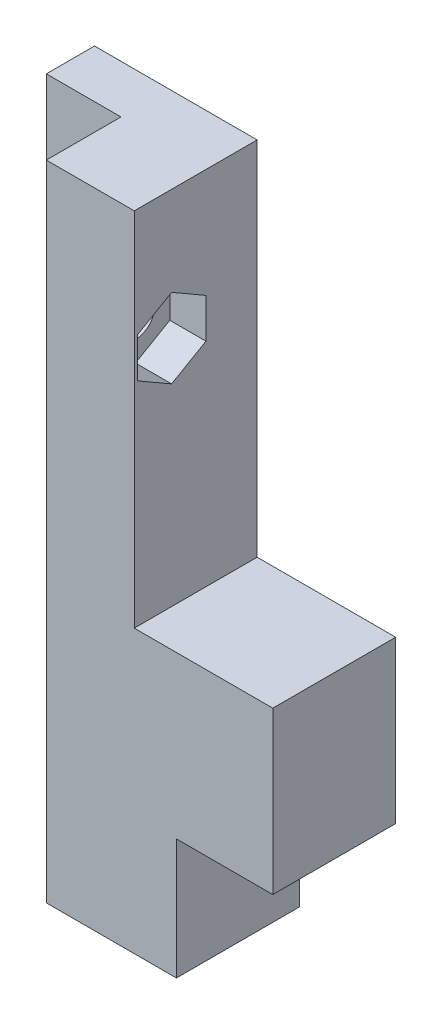
ISO-10303-21;
HEADER;
FILE_DESCRIPTION(('STEP AP214'),'2;1');
FILE_NAME('part.step','',(''),(''),'','','');
FILE_SCHEMA(('AUTOMOTIVE_DESIGN { 1 0 10303 214 1 1 1 1 }'));
ENDSEC;
DATA;
#1=APPLICATION_CONTEXT('core data for automotive mechanical design processes');
#2=APPLICATION_PROTOCOL_DEFINITION('international standard','automotive_design',2000,#1);
#3=PRODUCT_CONTEXT('',#1,'mechanical');
#4=PRODUCT('Part','Part','',(#3));
#5=PRODUCT_RELATED_PRODUCT_CATEGORY('part','',(#4));
#6=PRODUCT_DEFINITION_FORMATION('','',#4);
#7=PRODUCT_DEFINITION_CONTEXT('part definition',#1,'design');
#8=PRODUCT_DEFINITION('design','',#6,#7);
#9=PRODUCT_DEFINITION_SHAPE('','',#8);
#10=(LENGTH_UNIT() NAMED_UNIT(*) SI_UNIT(.MILLI.,.METRE.));
#11=(NAMED_UNIT(*) PLANE_ANGLE_UNIT() SI_UNIT($,.RADIAN.));
#12=(NAMED_UNIT(*) SI_UNIT($,.STERADIAN.) SOLID_ANGLE_UNIT());
#13=UNCERTAINTY_MEASURE_WITH_UNIT(LENGTH_MEASURE(1.E-05),#10,'distance_accuracy_value','');
#14=(GEOMETRIC_REPRESENTATION_CONTEXT(3) GLOBAL_UNCERTAINTY_ASSIGNED_CONTEXT((#13)) GLOBAL_UNIT_ASSIGNED_CONTEXT((#10,
#11,#12)) REPRESENTATION_CONTEXT('',''));
#15=CARTESIAN_POINT('',(0.,0.,0.));
#16=DIRECTION('',(0.,0.,1.));
#17=DIRECTION('',(1.,0.,0.));
#18=AXIS2_PLACEMENT_3D('',#15,#16,#17);
#19=CARTESIAN_POINT('',(25.001,24.3,7.1));
#20=DIRECTION('',(-1.,0.,0.));
#21=DIRECTION('',(0.,-1.,0.));
#22=AXIS2_PLACEMENT_3D('',#19,#20,#21);
#23=CYLINDRICAL_SURFACE('',#22,1.6);
#24=CARTESIAN_POINT('',(6.2,24.3,7.1));
#25=DIRECTION('',(-1.,0.,0.));
#26=DIRECTION('',(0.,-1.,0.));
#27=AXIS2_PLACEMENT_3D('',#24,#25,#26);
#28=CIRCLE('',#27,1.6);
#29=CARTESIAN_POINT('',(6.2,22.7,7.1));
#30=VERTEX_POINT('',#29);
#31=EDGE_CURVE('E206',#30,#30,#28,.T.);
#32=ORIENTED_EDGE('',*,*,#31,.T.);
#33=EDGE_LOOP('',(#32));
#34=FACE_BOUND('',#33,.T.);
#35=CARTESIAN_POINT('',(10.5,24.3,7.1));
#36=DIRECTION('',(1.,0.,0.));
#37=DIRECTION('',(0.,0.,-1.));
#38=AXIS2_PLACEMENT_3D('',#35,#36,#37);
#39=CIRCLE('',#38,1.6);
#40=CARTESIAN_POINT('',(10.5,24.3,5.5));
#41=VERTEX_POINT('',#40);
#42=EDGE_CURVE('E203',#41,#41,#39,.F.);
#43=ORIENTED_EDGE('',*,*,#42,.F.);
#44=EDGE_LOOP('',(#43));
#45=FACE_BOUND('',#44,.T.);
#46=ADVANCED_FACE('F31',(#34,#45),#23,.F.);
#47=CARTESIAN_POINT('',(0.,35.,4.));
#48=DIRECTION('',(0.,0.,-1.));
#49=DIRECTION('',(-1.,0.,0.));
#50=AXIS2_PLACEMENT_3D('',#47,#48,#49);
#51=PLANE('',#50);
#52=DIRECTION('',(0.,-1.,0.));
#53=VECTOR('',#52,1.);
#54=CARTESIAN_POINT('',(6.2,35.,4.));
#55=LINE('',#54,#53);
#56=CARTESIAN_POINT('',(6.2,35.,4.));
#57=VERTEX_POINT('',#56);
#58=CARTESIAN_POINT('',(6.2,-18.4,4.));
#59=VERTEX_POINT('',#58);
#60=EDGE_CURVE('E214',#57,#59,#55,.T.);
#61=ORIENTED_EDGE('',*,*,#60,.F.);
#62=DIRECTION('',(-1.,0.,0.));
#63=VECTOR('',#62,1.);
#64=CARTESIAN_POINT('',(0.,35.,4.));
#65=LINE('',#64,#63);
#66=CARTESIAN_POINT('',(0.,35.,4.));
#67=VERTEX_POINT('',#66);
#68=EDGE_CURVE('E152',#57,#67,#65,.T.);
#69=ORIENTED_EDGE('',*,*,#68,.T.);
#70=DIRECTION('',(0.,-1.,0.));
#71=VECTOR('',#70,1.);
#72=CARTESIAN_POINT('',(0.,0.,4.));
#73=LINE('',#72,#71);
#74=CARTESIAN_POINT('',(0.,-18.4,4.));
#75=VERTEX_POINT('',#74);
#76=EDGE_CURVE('E146',#67,#75,#73,.T.);
#77=ORIENTED_EDGE('',*,*,#76,.T.);
#78=DIRECTION('',(-1.,0.,0.));
#79=VECTOR('',#78,1.);
#80=CARTESIAN_POINT('',(6.2,-18.4,4.));
#81=LINE('',#80,#79);
#82=EDGE_CURVE('E150',#59,#75,#81,.T.);
#83=ORIENTED_EDGE('',*,*,#82,.F.);
#84=EDGE_LOOP('',(#61,#69,#77,#83));
#85=FACE_BOUND('',#84,.T.);
#86=ADVANCED_FACE('F148',(#85),#51,.F.);
#87=CARTESIAN_POINT('',(0.,0.,4.));
#88=DIRECTION('',(1.,0.,0.));
#89=DIRECTION('',(0.,0.,-1.));
#90=AXIS2_PLACEMENT_3D('',#87,#88,#89);
#91=PLANE('',#90);
#92=DIRECTION('',(0.,-1.,0.));
#93=VECTOR('',#92,1.);
#94=CARTESIAN_POINT('',(0.,0.,0.));
#95=LINE('',#94,#93);
#96=CARTESIAN_POINT('',(0.,35.,0.));
#97=VERTEX_POINT('',#96);
#98=CARTESIAN_POINT('',(0.,-18.4,0.));
#99=VERTEX_POINT('',#98);
#100=EDGE_CURVE('E161',#97,#99,#95,.T.);
#101=ORIENTED_EDGE('',*,*,#100,.T.);
#102=DIRECTION('',(0.,0.,-1.));
#103=VECTOR('',#102,1.);
#104=CARTESIAN_POINT('',(0.,-18.4,4.));
#105=LINE('',#104,#103);
#106=EDGE_CURVE('E159',#75,#99,#105,.T.);
#107=ORIENTED_EDGE('',*,*,#106,.F.);
#108=ORIENTED_EDGE('',*,*,#76,.F.);
#109=DIRECTION('',(0.,0.,-1.));
#110=VECTOR('',#109,1.);
#111=CARTESIAN_POINT('',(0.,35.,4.));
#112=LINE('',#111,#110);
#113=EDGE_CURVE('E232',#67,#97,#112,.T.);
#114=ORIENTED_EDGE('',*,*,#113,.T.);
#115=EDGE_LOOP('',(#101,#107,#108,#114));
#116=FACE_BOUND('',#115,.T.);
#117=ADVANCED_FACE('F33',(#116),#91,.F.);
#118=CARTESIAN_POINT('',(25.,0.,4.));
#119=DIRECTION('',(-1.,0.,0.));
#120=DIRECTION('',(0.,0.,1.));
#121=AXIS2_PLACEMENT_3D('',#118,#119,#120);
#122=PLANE('',#121);
#123=DIRECTION('',(0.,1.,0.));
#124=VECTOR('',#123,1.);
#125=CARTESIAN_POINT('',(25.,0.,0.));
#126=LINE('',#125,#124);
#127=CARTESIAN_POINT('',(25.,-8.4,0.));
#128=VERTEX_POINT('',#127);
#129=CARTESIAN_POINT('',(25.,5.,0.));
#130=VERTEX_POINT('',#129);
#131=EDGE_CURVE('E225',#128,#130,#126,.T.);
#132=ORIENTED_EDGE('',*,*,#131,.T.);
#133=DIRECTION('',(0.,0.,-1.));
#134=VECTOR('',#133,1.);
#135=CARTESIAN_POINT('',(25.,5.,4.));
#136=LINE('',#135,#134);
#137=CARTESIAN_POINT('',(25.,5.,10.2));
#138=VERTEX_POINT('',#137);
#139=EDGE_CURVE('E11',#138,#130,#136,.T.);
#140=ORIENTED_EDGE('',*,*,#139,.F.);
#141=DIRECTION('',(0.,1.,0.));
#142=VECTOR('',#141,1.);
#143=CARTESIAN_POINT('',(25.,0.,10.2));
#144=LINE('',#143,#142);
#145=CARTESIAN_POINT('',(25.,-8.4,10.2));
#146=VERTEX_POINT('',#145);
#147=EDGE_CURVE('E259',#146,#138,#144,.T.);
#148=ORIENTED_EDGE('',*,*,#147,.F.);
#149=DIRECTION('',(0.,0.,1.));
#150=VECTOR('',#149,1.);
#151=CARTESIAN_POINT('',(25.,-8.4,0.));
#152=LINE('',#151,#150);
#153=EDGE_CURVE('E199',#128,#146,#152,.T.);
#154=ORIENTED_EDGE('',*,*,#153,.F.);
#155=EDGE_LOOP('',(#132,#140,#148,#154));
#156=FACE_BOUND('',#155,.T.);
#157=ADVANCED_FACE('F346',(#156),#122,.F.);
#158=CARTESIAN_POINT('',(25.,5.,4.));
#159=DIRECTION('',(0.,-1.,0.));
#160=DIRECTION('',(1.,0.,0.));
#161=AXIS2_PLACEMENT_3D('',#158,#159,#160);
#162=PLANE('',#161);
#163=DIRECTION('',(-1.,0.,0.));
#164=VECTOR('',#163,1.);
#165=CARTESIAN_POINT('',(25.,5.,0.));
#166=LINE('',#165,#164);
#167=CARTESIAN_POINT('',(13.5,5.,0.));
#168=VERTEX_POINT('',#167);
#169=EDGE_CURVE('E227',#130,#168,#166,.T.);
#170=ORIENTED_EDGE('',*,*,#169,.T.);
#171=DIRECTION('',(0.,0.,-1.));
#172=VECTOR('',#171,1.);
#173=CARTESIAN_POINT('',(13.5,5.,4.));
#174=LINE('',#173,#172);
#175=CARTESIAN_POINT('',(13.5,5.,10.2));
#176=VERTEX_POINT('',#175);
#177=EDGE_CURVE('E40',#176,#168,#174,.T.);
#178=ORIENTED_EDGE('',*,*,#177,.F.);
#179=DIRECTION('',(-1.,0.,0.));
#180=VECTOR('',#179,1.);
#181=CARTESIAN_POINT('',(25.,5.,10.2));
#182=LINE('',#181,#180);
#183=EDGE_CURVE('E258',#138,#176,#182,.T.);
#184=ORIENTED_EDGE('',*,*,#183,.F.);
#185=ORIENTED_EDGE('',*,*,#139,.T.);
#186=EDGE_LOOP('',(#170,#178,#184,#185));
#187=FACE_BOUND('',#186,.T.);
#188=ADVANCED_FACE('F339',(#187),#162,.F.);
#189=CARTESIAN_POINT('',(13.5,35.,4.));
#190=DIRECTION('',(-1.,0.,0.));
#191=DIRECTION('',(0.,-1.,0.));
#192=AXIS2_PLACEMENT_3D('',#189,#190,#191);
#193=PLANE('',#192);
#194=DIRECTION('',(0.,-0.5,0.866025403784438));
#195=VECTOR('',#194,1.);
#196=CARTESIAN_POINT('',(13.5,27.5908965343809,7.1));
#197=LINE('',#196,#195);
#198=CARTESIAN_POINT('',(13.5,27.5908965343809,7.1));
#199=VERTEX_POINT('',#198);
#200=CARTESIAN_POINT('',(13.5,25.9454482671904,9.95000000000001));
#201=VERTEX_POINT('',#200);
#202=EDGE_CURVE('E292',#199,#201,#197,.T.);
#203=ORIENTED_EDGE('',*,*,#202,.F.);
#204=DIRECTION('',(0.,0.5,0.866025403784439));
#205=VECTOR('',#204,1.);
#206=CARTESIAN_POINT('',(13.5,25.9454482671904,4.25));
#207=LINE('',#206,#205);
#208=CARTESIAN_POINT('',(13.5,25.9454482671904,4.25));
#209=VERTEX_POINT('',#208);
#210=EDGE_CURVE('E56',#209,#199,#207,.T.);
#211=ORIENTED_EDGE('',*,*,#210,.F.);
#212=DIRECTION('',(0.,1.,0.));
#213=VECTOR('',#212,1.);
#214=CARTESIAN_POINT('',(13.5,22.6545517328096,4.25));
#215=LINE('',#214,#213);
#216=CARTESIAN_POINT('',(13.5,22.6545517328096,4.25));
#217=VERTEX_POINT('',#216);
#218=EDGE_CURVE('E279',#217,#209,#215,.T.);
#219=ORIENTED_EDGE('',*,*,#218,.F.);
#220=DIRECTION('',(0.,0.5,-0.866025403784439));
#221=VECTOR('',#220,1.);
#222=CARTESIAN_POINT('',(13.5,21.0091034656191,7.1));
#223=LINE('',#222,#221);
#224=CARTESIAN_POINT('',(13.5,21.0091034656191,7.1));
#225=VERTEX_POINT('',#224);
#226=EDGE_CURVE('E283',#225,#217,#223,.T.);
#227=ORIENTED_EDGE('',*,*,#226,.F.);
#228=DIRECTION('',(0.,-0.5,-0.866025403784438));
#229=VECTOR('',#228,1.);
#230=CARTESIAN_POINT('',(13.5,22.6545517328096,9.95000000000001));
#231=LINE('',#230,#229);
#232=CARTESIAN_POINT('',(13.5,22.6545517328096,9.95000000000001));
#233=VERTEX_POINT('',#232);
#234=EDGE_CURVE('E286',#233,#225,#231,.T.);
#235=ORIENTED_EDGE('',*,*,#234,.F.);
#236=DIRECTION('',(0.,-1.,0.));
#237=VECTOR('',#236,1.);
#238=CARTESIAN_POINT('',(13.5,25.9454482671904,9.95000000000001));
#239=LINE('',#238,#237);
#240=EDGE_CURVE('E289',#201,#233,#239,.T.);
#241=ORIENTED_EDGE('',*,*,#240,.F.);
#242=EDGE_LOOP('',(#203,#211,#219,#227,#235,#241));
#243=FACE_BOUND('',#242,.T.);
#244=DIRECTION('',(0.,1.,0.));
#245=VECTOR('',#244,1.);
#246=CARTESIAN_POINT('',(13.5,35.,0.));
#247=LINE('',#246,#245);
#248=CARTESIAN_POINT('',(13.5,35.,0.));
#249=VERTEX_POINT('',#248);
#250=EDGE_CURVE('E229',#168,#249,#247,.T.);
#251=ORIENTED_EDGE('',*,*,#250,.T.);
#252=DIRECTION('',(0.,0.,-1.));
#253=VECTOR('',#252,1.);
#254=CARTESIAN_POINT('',(13.5,35.,4.));
#255=LINE('',#254,#253);
#256=CARTESIAN_POINT('',(13.5,35.,10.2));
#257=VERTEX_POINT('',#256);
#258=EDGE_CURVE('E234',#257,#249,#255,.T.);
#259=ORIENTED_EDGE('',*,*,#258,.F.);
#260=DIRECTION('',(0.,1.,0.));
#261=VECTOR('',#260,1.);
#262=CARTESIAN_POINT('',(13.5,5.,10.2));
#263=LINE('',#262,#261);
#264=EDGE_CURVE('E213',#176,#257,#263,.T.);
#265=ORIENTED_EDGE('',*,*,#264,.F.);
#266=ORIENTED_EDGE('',*,*,#177,.T.);
#267=EDGE_LOOP('',(#251,#259,#265,#266));
#268=FACE_BOUND('',#267,.T.);
#269=ADVANCED_FACE('F241',(#243,#268),#193,.F.);
#270=CARTESIAN_POINT('',(0.,35.,4.));
#271=DIRECTION('',(0.,-1.,0.));
#272=DIRECTION('',(0.,0.,-1.));
#273=AXIS2_PLACEMENT_3D('',#270,#271,#272);
#274=PLANE('',#273);
#275=DIRECTION('',(-1.,0.,0.));
#276=VECTOR('',#275,1.);
#277=CARTESIAN_POINT('',(0.,35.,0.));
#278=LINE('',#277,#276);
#279=EDGE_CURVE('E156',#249,#97,#278,.T.);
#280=ORIENTED_EDGE('',*,*,#279,.T.);
#281=ORIENTED_EDGE('',*,*,#113,.F.);
#282=ORIENTED_EDGE('',*,*,#68,.F.);
#283=DIRECTION('',(0.,0.,-1.));
#284=VECTOR('',#283,1.);
#285=CARTESIAN_POINT('',(6.2,35.,10.2));
#286=LINE('',#285,#284);
#287=CARTESIAN_POINT('',(6.2,35.,10.2));
#288=VERTEX_POINT('',#287);
#289=EDGE_CURVE('E210',#288,#57,#286,.T.);
#290=ORIENTED_EDGE('',*,*,#289,.F.);
#291=DIRECTION('',(-1.,0.,0.));
#292=VECTOR('',#291,1.);
#293=CARTESIAN_POINT('',(13.5,35.,10.2));
#294=LINE('',#293,#292);
#295=EDGE_CURVE('E217',#257,#288,#294,.T.);
#296=ORIENTED_EDGE('',*,*,#295,.F.);
#297=ORIENTED_EDGE('',*,*,#258,.T.);
#298=EDGE_LOOP('',(#280,#281,#282,#290,#296,#297));
#299=FACE_BOUND('',#298,.T.);
#300=ADVANCED_FACE('F251',(#299),#274,.F.);
#301=CARTESIAN_POINT('',(0.,35.,0.));
#302=DIRECTION('',(0.,0.,-1.));
#303=DIRECTION('',(-1.,0.,0.));
#304=AXIS2_PLACEMENT_3D('',#301,#302,#303);
#305=PLANE('',#304);
#306=ORIENTED_EDGE('',*,*,#100,.F.);
#307=ORIENTED_EDGE('',*,*,#279,.F.);
#308=ORIENTED_EDGE('',*,*,#250,.F.);
#309=ORIENTED_EDGE('',*,*,#169,.F.);
#310=ORIENTED_EDGE('',*,*,#131,.F.);
#311=DIRECTION('',(1.,0.,0.));
#312=VECTOR('',#311,1.);
#313=CARTESIAN_POINT('',(0.,-8.4,0.));
#314=LINE('',#313,#312);
#315=CARTESIAN_POINT('',(17.,-8.4,0.));
#316=VERTEX_POINT('',#315);
#317=EDGE_CURVE('E195',#316,#128,#314,.T.);
#318=ORIENTED_EDGE('',*,*,#317,.F.);
#319=DIRECTION('',(0.,1.,0.));
#320=VECTOR('',#319,1.);
#321=CARTESIAN_POINT('',(17.,-18.4,0.));
#322=LINE('',#321,#320);
#323=CARTESIAN_POINT('',(17.,-18.4,0.));
#324=VERTEX_POINT('',#323);
#325=EDGE_CURVE('E192',#324,#316,#322,.T.);
#326=ORIENTED_EDGE('',*,*,#325,.F.);
#327=DIRECTION('',(1.,0.,0.));
#328=VECTOR('',#327,1.);
#329=CARTESIAN_POINT('',(0.,-18.4,0.));
#330=LINE('',#329,#328);
#331=EDGE_CURVE('E164',#99,#324,#330,.T.);
#332=ORIENTED_EDGE('',*,*,#331,.F.);
#333=EDGE_LOOP('',(#306,#307,#308,#309,#310,#318,#326,#332));
#334=FACE_BOUND('',#333,.T.);
#335=ADVANCED_FACE('F249',(#334),#305,.T.);
#336=CARTESIAN_POINT('',(6.2,35.,10.2));
#337=DIRECTION('',(1.,0.,0.));
#338=DIRECTION('',(0.,1.,0.));
#339=AXIS2_PLACEMENT_3D('',#336,#337,#338);
#340=PLANE('',#339);
#341=ORIENTED_EDGE('',*,*,#31,.F.);
#342=EDGE_LOOP('',(#341));
#343=FACE_BOUND('',#342,.T.);
#344=ORIENTED_EDGE('',*,*,#60,.T.);
#345=DIRECTION('',(0.,0.,-1.));
#346=VECTOR('',#345,1.);
#347=CARTESIAN_POINT('',(6.2,-18.4,10.2));
#348=LINE('',#347,#346);
#349=CARTESIAN_POINT('',(6.2,-18.4,10.2));
#350=VERTEX_POINT('',#349);
#351=EDGE_CURVE('E170',#350,#59,#348,.T.);
#352=ORIENTED_EDGE('',*,*,#351,.F.);
#353=DIRECTION('',(0.,-1.,0.));
#354=VECTOR('',#353,1.);
#355=CARTESIAN_POINT('',(6.2,35.,10.2));
#356=LINE('',#355,#354);
#357=EDGE_CURVE('E260',#288,#350,#356,.T.);
#358=ORIENTED_EDGE('',*,*,#357,.F.);
#359=ORIENTED_EDGE('',*,*,#289,.T.);
#360=EDGE_LOOP('',(#344,#352,#358,#359));
#361=FACE_BOUND('',#360,.T.);
#362=ADVANCED_FACE('F361',(#343,#361),#340,.F.);
#363=CARTESIAN_POINT('',(6.2,35.,10.2));
#364=DIRECTION('',(0.,0.,1.));
#365=DIRECTION('',(1.,0.,0.));
#366=AXIS2_PLACEMENT_3D('',#363,#364,#365);
#367=PLANE('',#366);
#368=ORIENTED_EDGE('',*,*,#295,.T.);
#369=ORIENTED_EDGE('',*,*,#357,.T.);
#370=DIRECTION('',(-1.,0.,0.));
#371=VECTOR('',#370,1.);
#372=CARTESIAN_POINT('',(17.,-18.4,10.2));
#373=LINE('',#372,#371);
#374=CARTESIAN_POINT('',(17.,-18.4,10.2));
#375=VERTEX_POINT('',#374);
#376=EDGE_CURVE('E177',#375,#350,#373,.T.);
#377=ORIENTED_EDGE('',*,*,#376,.F.);
#378=DIRECTION('',(0.,1.,0.));
#379=VECTOR('',#378,1.);
#380=CARTESIAN_POINT('',(17.,-18.4,10.2));
#381=LINE('',#380,#379);
#382=CARTESIAN_POINT('',(17.,-8.4,10.2));
#383=VERTEX_POINT('',#382);
#384=EDGE_CURVE('E180',#375,#383,#381,.T.);
#385=ORIENTED_EDGE('',*,*,#384,.T.);
#386=DIRECTION('',(-1.,0.,0.));
#387=VECTOR('',#386,1.);
#388=CARTESIAN_POINT('',(25.,-8.4,10.2));
#389=LINE('',#388,#387);
#390=EDGE_CURVE('E187',#146,#383,#389,.T.);
#391=ORIENTED_EDGE('',*,*,#390,.F.);
#392=ORIENTED_EDGE('',*,*,#147,.T.);
#393=ORIENTED_EDGE('',*,*,#183,.T.);
#394=ORIENTED_EDGE('',*,*,#264,.T.);
#395=EDGE_LOOP('',(#368,#369,#377,#385,#391,#392,#393,#394));
#396=FACE_BOUND('',#395,.T.);
#397=ADVANCED_FACE('F256',(#396),#367,.T.);
#398=CARTESIAN_POINT('',(10.5,27.5908965343809,7.1));
#399=DIRECTION('',(1.,0.,0.));
#400=DIRECTION('',(0.,0.,-1.));
#401=AXIS2_PLACEMENT_3D('',#398,#399,#400);
#402=PLANE('',#401);
#403=DIRECTION('',(0.,0.5,0.866025403784439));
#404=VECTOR('',#403,1.);
#405=CARTESIAN_POINT('',(10.5,25.9454482671904,4.25));
#406=LINE('',#405,#404);
#407=CARTESIAN_POINT('',(10.5,25.9454482671904,4.25));
#408=VERTEX_POINT('',#407);
#409=CARTESIAN_POINT('',(10.5,27.5908965343809,7.1));
#410=VERTEX_POINT('',#409);
#411=EDGE_CURVE('E282',#408,#410,#406,.T.);
#412=ORIENTED_EDGE('',*,*,#411,.T.);
#413=DIRECTION('',(0.,-0.5,0.866025403784438));
#414=VECTOR('',#413,1.);
#415=CARTESIAN_POINT('',(10.5,27.5908965343809,7.1));
#416=LINE('',#415,#414);
#417=CARTESIAN_POINT('',(10.5,25.9454482671904,9.95000000000001));
#418=VERTEX_POINT('',#417);
#419=EDGE_CURVE('E307',#410,#418,#416,.T.);
#420=ORIENTED_EDGE('',*,*,#419,.T.);
#421=DIRECTION('',(0.,-1.,0.));
#422=VECTOR('',#421,1.);
#423=CARTESIAN_POINT('',(10.5,25.9454482671904,9.95000000000001));
#424=LINE('',#423,#422);
#425=CARTESIAN_POINT('',(10.5,22.6545517328096,9.95000000000001));
#426=VERTEX_POINT('',#425);
#427=EDGE_CURVE('E304',#418,#426,#424,.T.);
#428=ORIENTED_EDGE('',*,*,#427,.T.);
#429=DIRECTION('',(0.,-0.5,-0.866025403784438));
#430=VECTOR('',#429,1.);
#431=CARTESIAN_POINT('',(10.5,22.6545517328096,9.95000000000001));
#432=LINE('',#431,#430);
#433=CARTESIAN_POINT('',(10.5,21.0091034656191,7.1));
#434=VERTEX_POINT('',#433);
#435=EDGE_CURVE('E301',#426,#434,#432,.T.);
#436=ORIENTED_EDGE('',*,*,#435,.T.);
#437=DIRECTION('',(0.,0.5,-0.866025403784439));
#438=VECTOR('',#437,1.);
#439=CARTESIAN_POINT('',(10.5,21.0091034656191,7.1));
#440=LINE('',#439,#438);
#441=CARTESIAN_POINT('',(10.5,22.6545517328096,4.25));
#442=VERTEX_POINT('',#441);
#443=EDGE_CURVE('E298',#434,#442,#440,.T.);
#444=ORIENTED_EDGE('',*,*,#443,.T.);
#445=DIRECTION('',(0.,1.,0.));
#446=VECTOR('',#445,1.);
#447=CARTESIAN_POINT('',(10.5,22.6545517328096,4.25));
#448=LINE('',#447,#446);
#449=EDGE_CURVE('E270',#442,#408,#448,.T.);
#450=ORIENTED_EDGE('',*,*,#449,.T.);
#451=EDGE_LOOP('',(#412,#420,#428,#436,#444,#450));
#452=FACE_BOUND('',#451,.T.);
#453=ORIENTED_EDGE('',*,*,#42,.T.);
#454=EDGE_LOOP('',(#453));
#455=FACE_BOUND('',#454,.T.);
#456=ADVANCED_FACE('F314',(#452,#455),#402,.T.);
#457=CARTESIAN_POINT('',(10.5,25.9454482671904,4.25));
#458=DIRECTION('',(0.,0.866025403784439,-0.5));
#459=DIRECTION('',(0.,0.5,0.866025403784439));
#460=AXIS2_PLACEMENT_3D('',#457,#458,#459);
#461=PLANE('',#460);
#462=ORIENTED_EDGE('',*,*,#210,.T.);
#463=DIRECTION('',(1.,0.,0.));
#464=VECTOR('',#463,1.);
#465=CARTESIAN_POINT('',(10.5,27.5908965343809,7.1));
#466=LINE('',#465,#464);
#467=EDGE_CURVE('E267',#410,#199,#466,.T.);
#468=ORIENTED_EDGE('',*,*,#467,.F.);
#469=ORIENTED_EDGE('',*,*,#411,.F.);
#470=DIRECTION('',(1.,0.,0.));
#471=VECTOR('',#470,1.);
#472=CARTESIAN_POINT('',(10.5,25.9454482671904,4.25));
#473=LINE('',#472,#471);
#474=EDGE_CURVE('E207',#408,#209,#473,.T.);
#475=ORIENTED_EDGE('',*,*,#474,.T.);
#476=EDGE_LOOP('',(#462,#468,#469,#475));
#477=FACE_BOUND('',#476,.T.);
#478=ADVANCED_FACE('F318',(#477),#461,.F.);
#479=CARTESIAN_POINT('',(10.5,22.6545517328096,4.25));
#480=DIRECTION('',(0.,0.,-1.));
#481=DIRECTION('',(-1.,0.,0.));
#482=AXIS2_PLACEMENT_3D('',#479,#480,#481);
#483=PLANE('',#482);
#484=ORIENTED_EDGE('',*,*,#218,.T.);
#485=ORIENTED_EDGE('',*,*,#474,.F.);
#486=ORIENTED_EDGE('',*,*,#449,.F.);
#487=DIRECTION('',(1.,0.,0.));
#488=VECTOR('',#487,1.);
#489=CARTESIAN_POINT('',(10.5,22.6545517328096,4.25));
#490=LINE('',#489,#488);
#491=EDGE_CURVE('E276',#442,#217,#490,.T.);
#492=ORIENTED_EDGE('',*,*,#491,.T.);
#493=EDGE_LOOP('',(#484,#485,#486,#492));
#494=FACE_BOUND('',#493,.T.);
#495=ADVANCED_FACE('F336',(#494),#483,.F.);
#496=CARTESIAN_POINT('',(10.5,21.0091034656191,7.1));
#497=DIRECTION('',(0.,-0.866025403784439,-0.5));
#498=DIRECTION('',(0.,0.5,-0.866025403784439));
#499=AXIS2_PLACEMENT_3D('',#496,#497,#498);
#500=PLANE('',#499);
#501=ORIENTED_EDGE('',*,*,#226,.T.);
#502=ORIENTED_EDGE('',*,*,#491,.F.);
#503=ORIENTED_EDGE('',*,*,#443,.F.);
#504=DIRECTION('',(1.,0.,0.));
#505=VECTOR('',#504,1.);
#506=CARTESIAN_POINT('',(10.5,21.0091034656191,7.1));
#507=LINE('',#506,#505);
#508=EDGE_CURVE('E274',#434,#225,#507,.T.);
#509=ORIENTED_EDGE('',*,*,#508,.T.);
#510=EDGE_LOOP('',(#501,#502,#503,#509));
#511=FACE_BOUND('',#510,.T.);
#512=ADVANCED_FACE('F333',(#511),#500,.F.);
#513=CARTESIAN_POINT('',(10.5,22.6545517328096,9.95000000000001));
#514=DIRECTION('',(0.,-0.866025403784438,0.5));
#515=DIRECTION('',(0.,-0.5,-0.866025403784438));
#516=AXIS2_PLACEMENT_3D('',#513,#514,#515);
#517=PLANE('',#516);
#518=ORIENTED_EDGE('',*,*,#234,.T.);
#519=ORIENTED_EDGE('',*,*,#508,.F.);
#520=ORIENTED_EDGE('',*,*,#435,.F.);
#521=DIRECTION('',(1.,0.,0.));
#522=VECTOR('',#521,1.);
#523=CARTESIAN_POINT('',(10.5,22.6545517328096,9.95000000000001));
#524=LINE('',#523,#522);
#525=EDGE_CURVE('E272',#426,#233,#524,.T.);
#526=ORIENTED_EDGE('',*,*,#525,.T.);
#527=EDGE_LOOP('',(#518,#519,#520,#526));
#528=FACE_BOUND('',#527,.T.);
#529=ADVANCED_FACE('F329',(#528),#517,.F.);
#530=CARTESIAN_POINT('',(10.5,25.9454482671904,9.95000000000001));
#531=DIRECTION('',(0.,0.,1.));
#532=DIRECTION('',(1.,0.,0.));
#533=AXIS2_PLACEMENT_3D('',#530,#531,#532);
#534=PLANE('',#533);
#535=ORIENTED_EDGE('',*,*,#240,.T.);
#536=ORIENTED_EDGE('',*,*,#525,.F.);
#537=ORIENTED_EDGE('',*,*,#427,.F.);
#538=DIRECTION('',(1.,0.,0.));
#539=VECTOR('',#538,1.);
#540=CARTESIAN_POINT('',(10.5,25.9454482671904,9.95000000000001));
#541=LINE('',#540,#539);
#542=EDGE_CURVE('E269',#418,#201,#541,.T.);
#543=ORIENTED_EDGE('',*,*,#542,.T.);
#544=EDGE_LOOP('',(#535,#536,#537,#543));
#545=FACE_BOUND('',#544,.T.);
#546=ADVANCED_FACE('F325',(#545),#534,.F.);
#547=CARTESIAN_POINT('',(10.5,27.5908965343809,7.1));
#548=DIRECTION('',(0.,0.866025403784439,0.5));
#549=DIRECTION('',(0.,-0.5,0.866025403784439));
#550=AXIS2_PLACEMENT_3D('',#547,#548,#549);
#551=PLANE('',#550);
#552=ORIENTED_EDGE('',*,*,#202,.T.);
#553=ORIENTED_EDGE('',*,*,#542,.F.);
#554=ORIENTED_EDGE('',*,*,#419,.F.);
#555=ORIENTED_EDGE('',*,*,#467,.T.);
#556=EDGE_LOOP('',(#552,#553,#554,#555));
#557=FACE_BOUND('',#556,.T.);
#558=ADVANCED_FACE('F321',(#557),#551,.F.);
#559=CARTESIAN_POINT('',(0.,-8.4,0.));
#560=DIRECTION('',(0.,-1.,0.));
#561=DIRECTION('',(0.,0.,-1.));
#562=AXIS2_PLACEMENT_3D('',#559,#560,#561);
#563=PLANE('',#562);
#564=DIRECTION('',(0.,0.,1.));
#565=VECTOR('',#564,1.);
#566=CARTESIAN_POINT('',(17.,-8.4,0.));
#567=LINE('',#566,#565);
#568=EDGE_CURVE('E48',#316,#383,#567,.T.);
#569=ORIENTED_EDGE('',*,*,#568,.F.);
#570=ORIENTED_EDGE('',*,*,#317,.T.);
#571=ORIENTED_EDGE('',*,*,#153,.T.);
#572=ORIENTED_EDGE('',*,*,#390,.T.);
#573=EDGE_LOOP('',(#569,#570,#571,#572));
#574=FACE_BOUND('',#573,.T.);
#575=ADVANCED_FACE('F421',(#574),#563,.T.);
#576=CARTESIAN_POINT('',(17.,-18.4,0.));
#577=DIRECTION('',(-1.,0.,0.));
#578=DIRECTION('',(0.,0.,1.));
#579=AXIS2_PLACEMENT_3D('',#576,#577,#578);
#580=PLANE('',#579);
#581=ORIENTED_EDGE('',*,*,#568,.T.);
#582=ORIENTED_EDGE('',*,*,#384,.F.);
#583=DIRECTION('',(0.,0.,1.));
#584=VECTOR('',#583,1.);
#585=CARTESIAN_POINT('',(17.,-18.4,0.));
#586=LINE('',#585,#584);
#587=EDGE_CURVE('E175',#324,#375,#586,.T.);
#588=ORIENTED_EDGE('',*,*,#587,.F.);
#589=ORIENTED_EDGE('',*,*,#325,.T.);
#590=EDGE_LOOP('',(#581,#582,#588,#589));
#591=FACE_BOUND('',#590,.T.);
#592=ADVANCED_FACE('F427',(#591),#580,.F.);
#593=CARTESIAN_POINT('',(0.,-18.4,4.));
#594=DIRECTION('',(0.,-1.,0.));
#595=DIRECTION('',(0.,0.,-1.));
#596=AXIS2_PLACEMENT_3D('',#593,#594,#595);
#597=PLANE('',#596);
#598=ORIENTED_EDGE('',*,*,#82,.T.);
#599=ORIENTED_EDGE('',*,*,#106,.T.);
#600=ORIENTED_EDGE('',*,*,#331,.T.);
#601=ORIENTED_EDGE('',*,*,#587,.T.);
#602=ORIENTED_EDGE('',*,*,#376,.T.);
#603=ORIENTED_EDGE('',*,*,#351,.T.);
#604=EDGE_LOOP('',(#598,#599,#600,#601,#602,#603));
#605=FACE_BOUND('',#604,.T.);
#606=ADVANCED_FACE('F167',(#605),#597,.T.);
#607=CLOSED_SHELL('',(#46,#86,#117,#157,#188,#269,#300,#335,#362,#397,#456,#478,#495,#512,#529,
#546,#558,#575,#592,#606));
#608=MANIFOLD_SOLID_BREP('B2',#607);
#609=ADVANCED_BREP_SHAPE_REPRESENTATION('',(#18,#608),#14);
#610=SHAPE_DEFINITION_REPRESENTATION(#9,#609);
ENDSEC;
END-ISO-10303-21;
